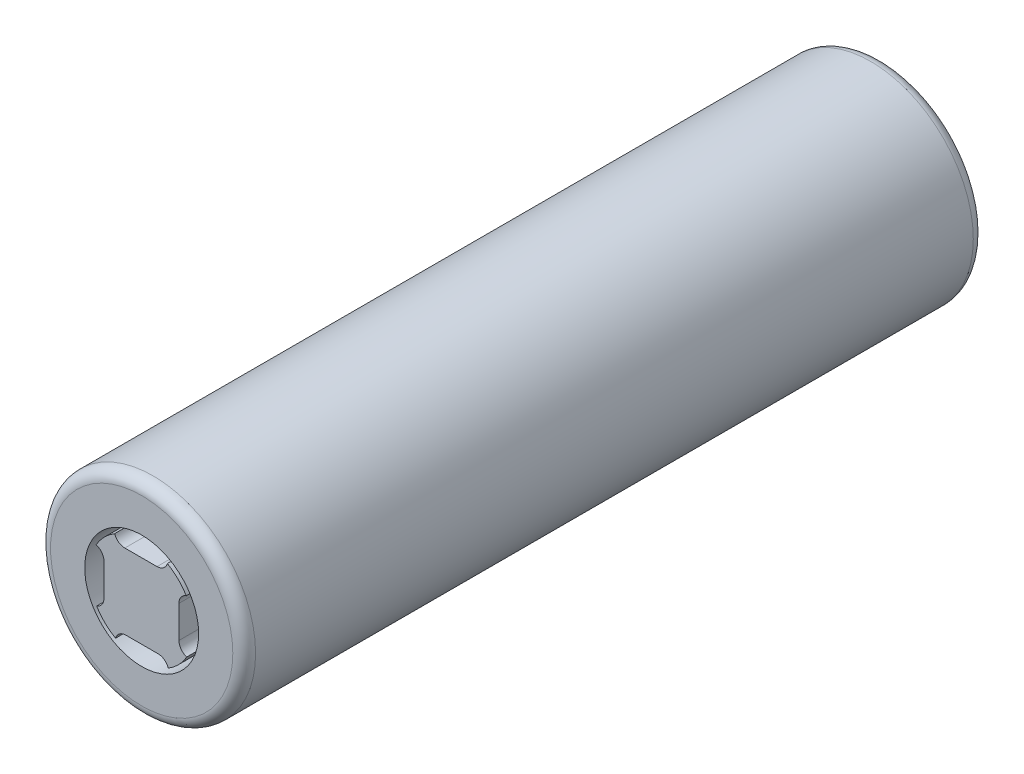
ISO-10303-21;
HEADER;
FILE_DESCRIPTION(('STEP AP214'),'2;1');
FILE_NAME('part.step','',(''),(''),'','','');
FILE_SCHEMA(('AUTOMOTIVE_DESIGN { 1 0 10303 214 1 1 1 1 }'));
ENDSEC;
DATA;
#1=APPLICATION_CONTEXT('core data for automotive mechanical design processes');
#2=APPLICATION_PROTOCOL_DEFINITION('international standard','automotive_design',2000,#1);
#3=PRODUCT_CONTEXT('',#1,'mechanical');
#4=PRODUCT('Part','Part','',(#3));
#5=PRODUCT_RELATED_PRODUCT_CATEGORY('part','',(#4));
#6=PRODUCT_DEFINITION_FORMATION('','',#4);
#7=PRODUCT_DEFINITION_CONTEXT('part definition',#1,'design');
#8=PRODUCT_DEFINITION('design','',#6,#7);
#9=PRODUCT_DEFINITION_SHAPE('','',#8);
#10=(LENGTH_UNIT() NAMED_UNIT(*) SI_UNIT(.MILLI.,.METRE.));
#11=(NAMED_UNIT(*) PLANE_ANGLE_UNIT() SI_UNIT($,.RADIAN.));
#12=(NAMED_UNIT(*) SI_UNIT($,.STERADIAN.) SOLID_ANGLE_UNIT());
#13=UNCERTAINTY_MEASURE_WITH_UNIT(LENGTH_MEASURE(1.E-05),#10,'distance_accuracy_value','');
#14=(GEOMETRIC_REPRESENTATION_CONTEXT(3) GLOBAL_UNCERTAINTY_ASSIGNED_CONTEXT((#13)) GLOBAL_UNIT_ASSIGNED_CONTEXT((#10,
#11,#12)) REPRESENTATION_CONTEXT('',''));
#15=CARTESIAN_POINT('',(0.,0.,0.));
#16=DIRECTION('',(0.,0.,1.));
#17=DIRECTION('',(1.,0.,0.));
#18=AXIS2_PLACEMENT_3D('',#15,#16,#17);
#19=CARTESIAN_POINT('',(0.,0.,-65.));
#20=DIRECTION('',(0.,0.,1.));
#21=DIRECTION('',(1.,0.,0.));
#22=AXIS2_PLACEMENT_3D('',#19,#20,#21);
#23=CYLINDRICAL_SURFACE('',#22,9.);
#24=CARTESIAN_POINT('',(0.,0.,-1.));
#25=DIRECTION('',(0.,0.,1.));
#26=DIRECTION('',(1.,0.,0.));
#27=AXIS2_PLACEMENT_3D('',#24,#25,#26);
#28=CIRCLE('',#27,9.);
#29=CARTESIAN_POINT('',(9.,0.,-1.));
#30=VERTEX_POINT('',#29);
#31=EDGE_CURVE('E52',#30,#30,#28,.F.);
#32=ORIENTED_EDGE('',*,*,#31,.T.);
#33=EDGE_LOOP('',(#32));
#34=FACE_BOUND('',#33,.T.);
#35=CARTESIAN_POINT('',(0.,0.,-64.));
#36=DIRECTION('',(0.,0.,1.));
#37=DIRECTION('',(1.,0.,0.));
#38=AXIS2_PLACEMENT_3D('',#35,#36,#37);
#39=CIRCLE('',#38,9.);
#40=CARTESIAN_POINT('',(9.,0.,-64.));
#41=VERTEX_POINT('',#40);
#42=EDGE_CURVE('E312',#41,#41,#39,.T.);
#43=ORIENTED_EDGE('',*,*,#42,.T.);
#44=EDGE_LOOP('',(#43));
#45=FACE_BOUND('',#44,.T.);
#46=ADVANCED_FACE('F43',(#34,#45),#23,.T.);
#47=CARTESIAN_POINT('',(0.,0.,-65.));
#48=DIRECTION('',(0.,0.,1.));
#49=DIRECTION('',(1.,0.,0.));
#50=AXIS2_PLACEMENT_3D('',#47,#48,#49);
#51=PLANE('',#50);
#52=CARTESIAN_POINT('',(0.,0.,-65.));
#53=DIRECTION('',(0.,0.,-1.));
#54=DIRECTION('',(-1.,0.,0.));
#55=AXIS2_PLACEMENT_3D('',#52,#53,#54);
#56=CIRCLE('',#55,6.5);
#57=CARTESIAN_POINT('',(-6.5,0.,-65.));
#58=VERTEX_POINT('',#57);
#59=EDGE_CURVE('E297',#58,#58,#56,.T.);
#60=ORIENTED_EDGE('',*,*,#59,.F.);
#61=EDGE_LOOP('',(#60));
#62=FACE_BOUND('',#61,.T.);
#63=CARTESIAN_POINT('',(0.,0.,-65.));
#64=DIRECTION('',(0.,0.,1.));
#65=DIRECTION('',(1.,0.,0.));
#66=AXIS2_PLACEMENT_3D('',#63,#64,#65);
#67=CIRCLE('',#66,8.);
#68=CARTESIAN_POINT('',(8.,0.,-65.));
#69=VERTEX_POINT('',#68);
#70=EDGE_CURVE('E11',#69,#69,#67,.F.);
#71=ORIENTED_EDGE('',*,*,#70,.T.);
#72=EDGE_LOOP('',(#71));
#73=FACE_BOUND('',#72,.T.);
#74=ADVANCED_FACE('F328',(#62,#73),#51,.F.);
#75=CARTESIAN_POINT('',(0.,0.,0.));
#76=DIRECTION('',(0.,0.,1.));
#77=DIRECTION('',(1.,0.,0.));
#78=AXIS2_PLACEMENT_3D('',#75,#76,#77);
#79=PLANE('',#78);
#80=CARTESIAN_POINT('',(0.,0.,0.));
#81=DIRECTION('',(0.,0.,1.));
#82=DIRECTION('',(1.,0.,0.));
#83=AXIS2_PLACEMENT_3D('',#80,#81,#82);
#84=CIRCLE('',#83,5.);
#85=CARTESIAN_POINT('',(5.,0.,0.));
#86=VERTEX_POINT('',#85);
#87=EDGE_CURVE('E292',#86,#86,#84,.T.);
#88=ORIENTED_EDGE('',*,*,#87,.F.);
#89=EDGE_LOOP('',(#88));
#90=FACE_BOUND('',#89,.T.);
#91=CARTESIAN_POINT('',(0.,0.,0.));
#92=DIRECTION('',(0.,0.,1.));
#93=DIRECTION('',(1.,0.,0.));
#94=AXIS2_PLACEMENT_3D('',#91,#92,#93);
#95=CIRCLE('',#94,8.);
#96=CARTESIAN_POINT('',(8.,0.,0.));
#97=VERTEX_POINT('',#96);
#98=EDGE_CURVE('E305',#97,#97,#95,.T.);
#99=ORIENTED_EDGE('',*,*,#98,.T.);
#100=EDGE_LOOP('',(#99));
#101=FACE_BOUND('',#100,.T.);
#102=ADVANCED_FACE('F324',(#90,#101),#79,.T.);
#103=CARTESIAN_POINT('',(0.,0.,-1.));
#104=DIRECTION('',(0.,0.,1.));
#105=DIRECTION('',(1.,0.,0.));
#106=AXIS2_PLACEMENT_3D('',#103,#104,#105);
#107=TOROIDAL_SURFACE('',#106,8.,1.);
#108=ORIENTED_EDGE('',*,*,#31,.F.);
#109=EDGE_LOOP('',(#108));
#110=FACE_BOUND('',#109,.T.);
#111=ORIENTED_EDGE('',*,*,#98,.F.);
#112=EDGE_LOOP('',(#111));
#113=FACE_BOUND('',#112,.T.);
#114=ADVANCED_FACE('F321',(#110,#113),#107,.T.);
#115=CARTESIAN_POINT('',(0.,0.,-64.));
#116=DIRECTION('',(0.,0.,1.));
#117=DIRECTION('',(1.,0.,0.));
#118=AXIS2_PLACEMENT_3D('',#115,#116,#117);
#119=TOROIDAL_SURFACE('',#118,8.,1.);
#120=ORIENTED_EDGE('',*,*,#70,.F.);
#121=EDGE_LOOP('',(#120));
#122=FACE_BOUND('',#121,.T.);
#123=ORIENTED_EDGE('',*,*,#42,.F.);
#124=EDGE_LOOP('',(#123));
#125=FACE_BOUND('',#124,.T.);
#126=ADVANCED_FACE('F45',(#122,#125),#119,.T.);
#127=CARTESIAN_POINT('',(0.,0.,-64.98));
#128=DIRECTION('',(0.,0.,-1.));
#129=DIRECTION('',(-1.,0.,0.));
#130=AXIS2_PLACEMENT_3D('',#127,#128,#129);
#131=CYLINDRICAL_SURFACE('',#130,6.5);
#132=CARTESIAN_POINT('',(0.,0.,-64.98));
#133=DIRECTION('',(0.,0.,-1.));
#134=DIRECTION('',(-1.,0.,0.));
#135=AXIS2_PLACEMENT_3D('',#132,#133,#134);
#136=CIRCLE('',#135,6.5);
#137=CARTESIAN_POINT('',(-6.5,0.,-64.98));
#138=VERTEX_POINT('',#137);
#139=EDGE_CURVE('E301',#138,#138,#136,.T.);
#140=ORIENTED_EDGE('',*,*,#139,.F.);
#141=EDGE_LOOP('',(#140));
#142=FACE_BOUND('',#141,.T.);
#143=ORIENTED_EDGE('',*,*,#59,.T.);
#144=EDGE_LOOP('',(#143));
#145=FACE_BOUND('',#144,.T.);
#146=ADVANCED_FACE('F360',(#142,#145),#131,.F.);
#147=CARTESIAN_POINT('',(0.,0.,-64.98));
#148=DIRECTION('',(0.,0.,-1.));
#149=DIRECTION('',(-1.,0.,0.));
#150=AXIS2_PLACEMENT_3D('',#147,#148,#149);
#151=PLANE('',#150);
#152=ORIENTED_EDGE('',*,*,#139,.T.);
#153=EDGE_LOOP('',(#152));
#154=FACE_BOUND('',#153,.T.);
#155=ADVANCED_FACE('F393',(#154),#151,.T.);
#156=CARTESIAN_POINT('',(0.,0.,-3.));
#157=DIRECTION('',(0.,0.,1.));
#158=DIRECTION('',(1.,0.,0.));
#159=AXIS2_PLACEMENT_3D('',#156,#157,#158);
#160=CYLINDRICAL_SURFACE('',#159,5.);
#161=CARTESIAN_POINT('',(0.,0.,-3.));
#162=DIRECTION('',(0.,0.,1.));
#163=DIRECTION('',(1.,0.,0.));
#164=AXIS2_PLACEMENT_3D('',#161,#162,#163);
#165=CIRCLE('',#164,5.);
#166=CARTESIAN_POINT('',(5.,0.,-3.));
#167=VERTEX_POINT('',#166);
#168=EDGE_CURVE('E293',#167,#167,#165,.T.);
#169=ORIENTED_EDGE('',*,*,#168,.F.);
#170=EDGE_LOOP('',(#169));
#171=FACE_BOUND('',#170,.T.);
#172=ORIENTED_EDGE('',*,*,#87,.T.);
#173=EDGE_LOOP('',(#172));
#174=FACE_BOUND('',#173,.T.);
#175=ADVANCED_FACE('F401',(#171,#174),#160,.F.);
#176=CARTESIAN_POINT('',(0.,0.,-3.));
#177=DIRECTION('',(0.,0.,1.));
#178=DIRECTION('',(1.,0.,0.));
#179=AXIS2_PLACEMENT_3D('',#176,#177,#178);
#180=PLANE('',#179);
#181=CARTESIAN_POINT('',(1.45860825628299,-4.23652875202125,-3.));
#182=DIRECTION('',(0.,0.,1.));
#183=DIRECTION('',(1.,0.,0.));
#184=AXIS2_PLACEMENT_3D('',#181,#182,#183);
#185=CIRCLE('',#184,0.946820821160264);
#186=CARTESIAN_POINT('',(2.35476678849302,-3.93096443386589,-3.));
#187=VERTEX_POINT('',#186);
#188=CARTESIAN_POINT('',(1.45860825628299,-3.28970793086098,-3.));
#189=VERTEX_POINT('',#188);
#190=EDGE_CURVE('E191',#187,#189,#185,.T.);
#191=ORIENTED_EDGE('',*,*,#190,.T.);
#192=DIRECTION('',(1.,0.,0.));
#193=VECTOR('',#192,1.);
#194=CARTESIAN_POINT('',(0.,-3.28970793086098,-3.));
#195=LINE('',#194,#193);
#196=CARTESIAN_POINT('',(-1.36442356825004,-3.28970793086098,-3.));
#197=VERTEX_POINT('',#196);
#198=EDGE_CURVE('E247',#197,#189,#195,.T.);
#199=ORIENTED_EDGE('',*,*,#198,.F.);
#200=CARTESIAN_POINT('',(-1.36442356825004,-4.23652875202125,-3.));
#201=DIRECTION('',(0.,0.,1.));
#202=DIRECTION('',(1.,0.,0.));
#203=AXIS2_PLACEMENT_3D('',#200,#201,#202);
#204=CIRCLE('',#203,0.946820821160266);
#205=CARTESIAN_POINT('',(-2.27514519868079,-3.97757744530865,-3.));
#206=VERTEX_POINT('',#205);
#207=EDGE_CURVE('E59',#197,#206,#204,.T.);
#208=ORIENTED_EDGE('',*,*,#207,.T.);
#209=CARTESIAN_POINT('',(0.,0.,-3.));
#210=DIRECTION('',(0.,0.,1.));
#211=DIRECTION('',(1.,0.,0.));
#212=AXIS2_PLACEMENT_3D('',#209,#210,#211);
#213=CIRCLE('',#212,4.58229287677123);
#214=CARTESIAN_POINT('',(-3.9309644338659,-2.35476678849301,-3.));
#215=VERTEX_POINT('',#214);
#216=EDGE_CURVE('E179',#215,#206,#213,.T.);
#217=ORIENTED_EDGE('',*,*,#216,.F.);
#218=CARTESIAN_POINT('',(-4.23652875202125,-1.45860825628297,-3.));
#219=DIRECTION('',(0.,0.,1.));
#220=DIRECTION('',(1.,0.,0.));
#221=AXIS2_PLACEMENT_3D('',#218,#219,#220);
#222=CIRCLE('',#221,0.946820821160266);
#223=CARTESIAN_POINT('',(-3.28970793086099,-1.45860825628298,-3.));
#224=VERTEX_POINT('',#223);
#225=EDGE_CURVE('E239',#215,#224,#222,.T.);
#226=ORIENTED_EDGE('',*,*,#225,.T.);
#227=DIRECTION('',(0.,-1.,0.));
#228=VECTOR('',#227,1.);
#229=CARTESIAN_POINT('',(-3.28970793086098,0.,-3.));
#230=LINE('',#229,#228);
#231=CARTESIAN_POINT('',(-3.28970793086098,1.36442356825005,-3.));
#232=VERTEX_POINT('',#231);
#233=EDGE_CURVE('E235',#232,#224,#230,.T.);
#234=ORIENTED_EDGE('',*,*,#233,.F.);
#235=CARTESIAN_POINT('',(-4.23652875202124,1.36442356825006,-3.));
#236=DIRECTION('',(0.,0.,1.));
#237=DIRECTION('',(1.,0.,0.));
#238=AXIS2_PLACEMENT_3D('',#235,#236,#237);
#239=CIRCLE('',#238,0.946820821160266);
#240=CARTESIAN_POINT('',(-3.97757744530864,2.2751451986808,-3.));
#241=VERTEX_POINT('',#240);
#242=EDGE_CURVE('E231',#232,#241,#239,.T.);
#243=ORIENTED_EDGE('',*,*,#242,.T.);
#244=CARTESIAN_POINT('',(0.,0.,-3.));
#245=DIRECTION('',(0.,0.,1.));
#246=DIRECTION('',(1.,0.,0.));
#247=AXIS2_PLACEMENT_3D('',#244,#245,#246);
#248=CIRCLE('',#247,4.58229287677123);
#249=CARTESIAN_POINT('',(-2.354766788493,3.93096443386591,-3.));
#250=VERTEX_POINT('',#249);
#251=EDGE_CURVE('E227',#250,#241,#248,.T.);
#252=ORIENTED_EDGE('',*,*,#251,.F.);
#253=CARTESIAN_POINT('',(-1.45860825628296,4.23652875202126,-3.));
#254=DIRECTION('',(0.,0.,1.));
#255=DIRECTION('',(1.,0.,0.));
#256=AXIS2_PLACEMENT_3D('',#253,#254,#255);
#257=CIRCLE('',#256,0.946820821160266);
#258=CARTESIAN_POINT('',(-1.45860825628296,3.28970793086099,-3.));
#259=VERTEX_POINT('',#258);
#260=EDGE_CURVE('E223',#250,#259,#257,.T.);
#261=ORIENTED_EDGE('',*,*,#260,.T.);
#262=DIRECTION('',(-1.,0.,0.));
#263=VECTOR('',#262,1.);
#264=CARTESIAN_POINT('',(0.,3.28970793086098,-3.));
#265=LINE('',#264,#263);
#266=CARTESIAN_POINT('',(1.36442356825007,3.28970793086098,-3.));
#267=VERTEX_POINT('',#266);
#268=EDGE_CURVE('E219',#267,#259,#265,.T.);
#269=ORIENTED_EDGE('',*,*,#268,.F.);
#270=CARTESIAN_POINT('',(1.36442356825007,4.23652875202124,-3.));
#271=DIRECTION('',(0.,0.,1.));
#272=DIRECTION('',(1.,0.,0.));
#273=AXIS2_PLACEMENT_3D('',#270,#271,#272);
#274=CIRCLE('',#273,0.946820821160266);
#275=CARTESIAN_POINT('',(2.27514519868082,3.97757744530863,-3.));
#276=VERTEX_POINT('',#275);
#277=EDGE_CURVE('E215',#267,#276,#274,.T.);
#278=ORIENTED_EDGE('',*,*,#277,.T.);
#279=CARTESIAN_POINT('',(0.,0.,-3.));
#280=DIRECTION('',(0.,0.,1.));
#281=DIRECTION('',(1.,0.,0.));
#282=AXIS2_PLACEMENT_3D('',#279,#280,#281);
#283=CIRCLE('',#282,4.58229287677123);
#284=CARTESIAN_POINT('',(3.93096443386591,2.35476678849298,-3.));
#285=VERTEX_POINT('',#284);
#286=EDGE_CURVE('E211',#285,#276,#283,.T.);
#287=ORIENTED_EDGE('',*,*,#286,.F.);
#288=CARTESIAN_POINT('',(4.23652875202126,1.45860825628294,-3.));
#289=DIRECTION('',(0.,0.,1.));
#290=DIRECTION('',(1.,0.,0.));
#291=AXIS2_PLACEMENT_3D('',#288,#289,#290);
#292=CIRCLE('',#291,0.946820821160266);
#293=CARTESIAN_POINT('',(3.289707930861,1.45860825628295,-3.));
#294=VERTEX_POINT('',#293);
#295=EDGE_CURVE('E207',#285,#294,#292,.T.);
#296=ORIENTED_EDGE('',*,*,#295,.T.);
#297=DIRECTION('',(0.,1.,0.));
#298=VECTOR('',#297,1.);
#299=CARTESIAN_POINT('',(3.28970793086098,0.,-3.));
#300=LINE('',#299,#298);
#301=CARTESIAN_POINT('',(3.28970793086097,-1.36442356825008,-3.));
#302=VERTEX_POINT('',#301);
#303=EDGE_CURVE('E203',#302,#294,#300,.T.);
#304=ORIENTED_EDGE('',*,*,#303,.F.);
#305=CARTESIAN_POINT('',(4.23652875202124,-1.36442356825009,-3.));
#306=DIRECTION('',(0.,0.,1.));
#307=DIRECTION('',(1.,0.,0.));
#308=AXIS2_PLACEMENT_3D('',#305,#306,#307);
#309=CIRCLE('',#308,0.946820821160266);
#310=CARTESIAN_POINT('',(3.97757744530862,-2.27514519868083,-3.));
#311=VERTEX_POINT('',#310);
#312=EDGE_CURVE('E199',#302,#311,#309,.T.);
#313=ORIENTED_EDGE('',*,*,#312,.T.);
#314=CARTESIAN_POINT('',(0.,0.,-3.));
#315=DIRECTION('',(0.,0.,1.));
#316=DIRECTION('',(1.,0.,0.));
#317=AXIS2_PLACEMENT_3D('',#314,#315,#316);
#318=CIRCLE('',#317,4.58229287677123);
#319=EDGE_CURVE('E195',#187,#311,#318,.T.);
#320=ORIENTED_EDGE('',*,*,#319,.F.);
#321=EDGE_LOOP('',(#191,#199,#208,#217,#226,#234,#243,#252,#261,#269,#278,#287,#296,#304,#313,#320));
#322=FACE_BOUND('',#321,.T.);
#323=ORIENTED_EDGE('',*,*,#168,.T.);
#324=EDGE_LOOP('',(#323));
#325=FACE_BOUND('',#324,.T.);
#326=ADVANCED_FACE('F409',(#322,#325),#180,.T.);
#327=CARTESIAN_POINT('',(1.45860825628299,-4.23652875202125,0.0200000000000001));
#328=DIRECTION('',(0.,0.,-1.));
#329=DIRECTION('',(-1.,0.,0.));
#330=AXIS2_PLACEMENT_3D('',#327,#328,#329);
#331=CYLINDRICAL_SURFACE('',#330,0.946820821160264);
#332=ORIENTED_EDGE('',*,*,#190,.F.);
#333=DIRECTION('',(0.,0.,-1.));
#334=VECTOR('',#333,1.);
#335=CARTESIAN_POINT('',(2.35476678849302,-3.93096443386589,0.0200000000000001));
#336=LINE('',#335,#334);
#337=CARTESIAN_POINT('',(2.35476678849302,-3.93096443386589,0.0200000000000001));
#338=VERTEX_POINT('',#337);
#339=EDGE_CURVE('E125',#338,#187,#336,.T.);
#340=ORIENTED_EDGE('',*,*,#339,.F.);
#341=CARTESIAN_POINT('',(1.45860825628299,-4.23652875202125,0.0200000000000001));
#342=DIRECTION('',(0.,0.,1.));
#343=DIRECTION('',(1.,0.,0.));
#344=AXIS2_PLACEMENT_3D('',#341,#342,#343);
#345=CIRCLE('',#344,0.946820821160264);
#346=CARTESIAN_POINT('',(1.45860825628299,-3.28970793086098,0.0200000000000001));
#347=VERTEX_POINT('',#346);
#348=EDGE_CURVE('E250',#338,#347,#345,.T.);
#349=ORIENTED_EDGE('',*,*,#348,.T.);
#350=DIRECTION('',(0.,0.,-1.));
#351=VECTOR('',#350,1.);
#352=CARTESIAN_POINT('',(1.45860825628299,-3.28970793086098,0.0200000000000001));
#353=LINE('',#352,#351);
#354=EDGE_CURVE('E120',#347,#189,#353,.T.);
#355=ORIENTED_EDGE('',*,*,#354,.T.);
#356=EDGE_LOOP('',(#332,#340,#349,#355));
#357=FACE_BOUND('',#356,.T.);
#358=ADVANCED_FACE('F418',(#357),#331,.F.);
#359=CARTESIAN_POINT('',(0.,0.,0.0200000000000001));
#360=DIRECTION('',(0.,0.,-1.));
#361=DIRECTION('',(-1.,0.,0.));
#362=AXIS2_PLACEMENT_3D('',#359,#360,#361);
#363=CYLINDRICAL_SURFACE('',#362,4.58229287677123);
#364=ORIENTED_EDGE('',*,*,#319,.T.);
#365=DIRECTION('',(0.,0.,-1.));
#366=VECTOR('',#365,1.);
#367=CARTESIAN_POINT('',(3.97757744530862,-2.27514519868083,0.0200000000000001));
#368=LINE('',#367,#366);
#369=CARTESIAN_POINT('',(3.97757744530862,-2.27514519868083,0.0200000000000001));
#370=VERTEX_POINT('',#369);
#371=EDGE_CURVE('E287',#370,#311,#368,.T.);
#372=ORIENTED_EDGE('',*,*,#371,.F.);
#373=CARTESIAN_POINT('',(0.,0.,0.0200000000000001));
#374=DIRECTION('',(0.,0.,1.));
#375=DIRECTION('',(1.,0.,0.));
#376=AXIS2_PLACEMENT_3D('',#373,#374,#375);
#377=CIRCLE('',#376,4.58229287677123);
#378=EDGE_CURVE('E629',#338,#370,#377,.T.);
#379=ORIENTED_EDGE('',*,*,#378,.F.);
#380=ORIENTED_EDGE('',*,*,#339,.T.);
#381=EDGE_LOOP('',(#364,#372,#379,#380));
#382=FACE_BOUND('',#381,.T.);
#383=ADVANCED_FACE('F427',(#382),#363,.T.);
#384=CARTESIAN_POINT('',(4.23652875202124,-1.36442356825009,0.0200000000000001));
#385=DIRECTION('',(0.,0.,-1.));
#386=DIRECTION('',(-1.,0.,0.));
#387=AXIS2_PLACEMENT_3D('',#384,#385,#386);
#388=CYLINDRICAL_SURFACE('',#387,0.946820821160266);
#389=ORIENTED_EDGE('',*,*,#312,.F.);
#390=DIRECTION('',(0.,0.,-1.));
#391=VECTOR('',#390,1.);
#392=CARTESIAN_POINT('',(3.28970793086097,-1.36442356825008,0.0200000000000001));
#393=LINE('',#392,#391);
#394=CARTESIAN_POINT('',(3.28970793086097,-1.36442356825008,0.0200000000000001));
#395=VERTEX_POINT('',#394);
#396=EDGE_CURVE('E284',#395,#302,#393,.T.);
#397=ORIENTED_EDGE('',*,*,#396,.F.);
#398=CARTESIAN_POINT('',(4.23652875202124,-1.36442356825009,0.0200000000000001));
#399=DIRECTION('',(0.,0.,1.));
#400=DIRECTION('',(1.,0.,0.));
#401=AXIS2_PLACEMENT_3D('',#398,#399,#400);
#402=CIRCLE('',#401,0.946820821160266);
#403=EDGE_CURVE('E632',#395,#370,#402,.T.);
#404=ORIENTED_EDGE('',*,*,#403,.T.);
#405=ORIENTED_EDGE('',*,*,#371,.T.);
#406=EDGE_LOOP('',(#389,#397,#404,#405));
#407=FACE_BOUND('',#406,.T.);
#408=ADVANCED_FACE('F435',(#407),#388,.F.);
#409=CARTESIAN_POINT('',(3.28970793086098,0.,0.0200000000000001));
#410=DIRECTION('',(-1.,0.,0.));
#411=DIRECTION('',(0.,-1.,0.));
#412=AXIS2_PLACEMENT_3D('',#409,#410,#411);
#413=PLANE('',#412);
#414=ORIENTED_EDGE('',*,*,#303,.T.);
#415=DIRECTION('',(0.,0.,-1.));
#416=VECTOR('',#415,1.);
#417=CARTESIAN_POINT('',(3.289707930861,1.45860825628295,0.0200000000000001));
#418=LINE('',#417,#416);
#419=CARTESIAN_POINT('',(3.289707930861,1.45860825628295,0.0200000000000001));
#420=VERTEX_POINT('',#419);
#421=EDGE_CURVE('E281',#420,#294,#418,.T.);
#422=ORIENTED_EDGE('',*,*,#421,.F.);
#423=DIRECTION('',(0.,1.,0.));
#424=VECTOR('',#423,1.);
#425=CARTESIAN_POINT('',(3.28970793086098,0.,0.0200000000000001));
#426=LINE('',#425,#424);
#427=EDGE_CURVE('E639',#395,#420,#426,.T.);
#428=ORIENTED_EDGE('',*,*,#427,.F.);
#429=ORIENTED_EDGE('',*,*,#396,.T.);
#430=EDGE_LOOP('',(#414,#422,#428,#429));
#431=FACE_BOUND('',#430,.T.);
#432=ADVANCED_FACE('F453',(#431),#413,.F.);
#433=CARTESIAN_POINT('',(4.23652875202126,1.45860825628294,0.0200000000000001));
#434=DIRECTION('',(0.,0.,-1.));
#435=DIRECTION('',(-1.,0.,0.));
#436=AXIS2_PLACEMENT_3D('',#433,#434,#435);
#437=CYLINDRICAL_SURFACE('',#436,0.946820821160266);
#438=ORIENTED_EDGE('',*,*,#295,.F.);
#439=DIRECTION('',(0.,0.,-1.));
#440=VECTOR('',#439,1.);
#441=CARTESIAN_POINT('',(3.93096443386591,2.35476678849298,0.0200000000000001));
#442=LINE('',#441,#440);
#443=CARTESIAN_POINT('',(3.93096443386591,2.35476678849298,0.0200000000000001));
#444=VERTEX_POINT('',#443);
#445=EDGE_CURVE('E278',#444,#285,#442,.T.);
#446=ORIENTED_EDGE('',*,*,#445,.F.);
#447=CARTESIAN_POINT('',(4.23652875202126,1.45860825628294,0.0200000000000001));
#448=DIRECTION('',(0.,0.,1.));
#449=DIRECTION('',(1.,0.,0.));
#450=AXIS2_PLACEMENT_3D('',#447,#448,#449);
#451=CIRCLE('',#450,0.946820821160266);
#452=EDGE_CURVE('E642',#444,#420,#451,.T.);
#453=ORIENTED_EDGE('',*,*,#452,.T.);
#454=ORIENTED_EDGE('',*,*,#421,.T.);
#455=EDGE_LOOP('',(#438,#446,#453,#454));
#456=FACE_BOUND('',#455,.T.);
#457=ADVANCED_FACE('F462',(#456),#437,.F.);
#458=CARTESIAN_POINT('',(0.,0.,0.0200000000000001));
#459=DIRECTION('',(0.,0.,-1.));
#460=DIRECTION('',(-1.,0.,0.));
#461=AXIS2_PLACEMENT_3D('',#458,#459,#460);
#462=CYLINDRICAL_SURFACE('',#461,4.58229287677123);
#463=ORIENTED_EDGE('',*,*,#286,.T.);
#464=DIRECTION('',(0.,0.,-1.));
#465=VECTOR('',#464,1.);
#466=CARTESIAN_POINT('',(2.27514519868082,3.97757744530863,0.0200000000000001));
#467=LINE('',#466,#465);
#468=CARTESIAN_POINT('',(2.27514519868082,3.97757744530863,0.0200000000000001));
#469=VERTEX_POINT('',#468);
#470=EDGE_CURVE('E275',#469,#276,#467,.T.);
#471=ORIENTED_EDGE('',*,*,#470,.F.);
#472=CARTESIAN_POINT('',(0.,0.,0.0200000000000001));
#473=DIRECTION('',(0.,0.,1.));
#474=DIRECTION('',(1.,0.,0.));
#475=AXIS2_PLACEMENT_3D('',#472,#473,#474);
#476=CIRCLE('',#475,4.58229287677123);
#477=EDGE_CURVE('E646',#444,#469,#476,.T.);
#478=ORIENTED_EDGE('',*,*,#477,.F.);
#479=ORIENTED_EDGE('',*,*,#445,.T.);
#480=EDGE_LOOP('',(#463,#471,#478,#479));
#481=FACE_BOUND('',#480,.T.);
#482=ADVANCED_FACE('F471',(#481),#462,.T.);
#483=CARTESIAN_POINT('',(1.36442356825007,4.23652875202124,0.0200000000000001));
#484=DIRECTION('',(0.,0.,-1.));
#485=DIRECTION('',(-1.,0.,0.));
#486=AXIS2_PLACEMENT_3D('',#483,#484,#485);
#487=CYLINDRICAL_SURFACE('',#486,0.946820821160266);
#488=ORIENTED_EDGE('',*,*,#277,.F.);
#489=DIRECTION('',(0.,0.,-1.));
#490=VECTOR('',#489,1.);
#491=CARTESIAN_POINT('',(1.36442356825007,3.28970793086098,0.0200000000000001));
#492=LINE('',#491,#490);
#493=CARTESIAN_POINT('',(1.36442356825007,3.28970793086098,0.0200000000000001));
#494=VERTEX_POINT('',#493);
#495=EDGE_CURVE('E272',#494,#267,#492,.T.);
#496=ORIENTED_EDGE('',*,*,#495,.F.);
#497=CARTESIAN_POINT('',(1.36442356825007,4.23652875202124,0.0200000000000001));
#498=DIRECTION('',(0.,0.,1.));
#499=DIRECTION('',(1.,0.,0.));
#500=AXIS2_PLACEMENT_3D('',#497,#498,#499);
#501=CIRCLE('',#500,0.946820821160266);
#502=EDGE_CURVE('E649',#494,#469,#501,.T.);
#503=ORIENTED_EDGE('',*,*,#502,.T.);
#504=ORIENTED_EDGE('',*,*,#470,.T.);
#505=EDGE_LOOP('',(#488,#496,#503,#504));
#506=FACE_BOUND('',#505,.T.);
#507=ADVANCED_FACE('F480',(#506),#487,.F.);
#508=CARTESIAN_POINT('',(0.,3.28970793086098,0.0200000000000001));
#509=DIRECTION('',(0.,-1.,0.));
#510=DIRECTION('',(1.,0.,0.));
#511=AXIS2_PLACEMENT_3D('',#508,#509,#510);
#512=PLANE('',#511);
#513=ORIENTED_EDGE('',*,*,#268,.T.);
#514=DIRECTION('',(0.,0.,-1.));
#515=VECTOR('',#514,1.);
#516=CARTESIAN_POINT('',(-1.45860825628296,3.28970793086099,0.0200000000000001));
#517=LINE('',#516,#515);
#518=CARTESIAN_POINT('',(-1.45860825628296,3.28970793086099,0.0200000000000001));
#519=VERTEX_POINT('',#518);
#520=EDGE_CURVE('E269',#519,#259,#517,.T.);
#521=ORIENTED_EDGE('',*,*,#520,.F.);
#522=DIRECTION('',(-1.,0.,0.));
#523=VECTOR('',#522,1.);
#524=CARTESIAN_POINT('',(0.,3.28970793086098,0.0200000000000001));
#525=LINE('',#524,#523);
#526=EDGE_CURVE('E653',#494,#519,#525,.T.);
#527=ORIENTED_EDGE('',*,*,#526,.F.);
#528=ORIENTED_EDGE('',*,*,#495,.T.);
#529=EDGE_LOOP('',(#513,#521,#527,#528));
#530=FACE_BOUND('',#529,.T.);
#531=ADVANCED_FACE('F498',(#530),#512,.F.);
#532=CARTESIAN_POINT('',(-1.45860825628296,4.23652875202126,0.0200000000000001));
#533=DIRECTION('',(0.,0.,-1.));
#534=DIRECTION('',(-1.,0.,0.));
#535=AXIS2_PLACEMENT_3D('',#532,#533,#534);
#536=CYLINDRICAL_SURFACE('',#535,0.946820821160266);
#537=ORIENTED_EDGE('',*,*,#260,.F.);
#538=DIRECTION('',(0.,0.,-1.));
#539=VECTOR('',#538,1.);
#540=CARTESIAN_POINT('',(-2.354766788493,3.93096443386591,0.0200000000000001));
#541=LINE('',#540,#539);
#542=CARTESIAN_POINT('',(-2.354766788493,3.93096443386591,0.0200000000000001));
#543=VERTEX_POINT('',#542);
#544=EDGE_CURVE('E266',#543,#250,#541,.T.);
#545=ORIENTED_EDGE('',*,*,#544,.F.);
#546=CARTESIAN_POINT('',(-1.45860825628296,4.23652875202126,0.0200000000000001));
#547=DIRECTION('',(0.,0.,1.));
#548=DIRECTION('',(1.,0.,0.));
#549=AXIS2_PLACEMENT_3D('',#546,#547,#548);
#550=CIRCLE('',#549,0.946820821160266);
#551=EDGE_CURVE('E656',#543,#519,#550,.T.);
#552=ORIENTED_EDGE('',*,*,#551,.T.);
#553=ORIENTED_EDGE('',*,*,#520,.T.);
#554=EDGE_LOOP('',(#537,#545,#552,#553));
#555=FACE_BOUND('',#554,.T.);
#556=ADVANCED_FACE('F507',(#555),#536,.F.);
#557=CARTESIAN_POINT('',(0.,0.,0.0200000000000001));
#558=DIRECTION('',(0.,0.,-1.));
#559=DIRECTION('',(-1.,0.,0.));
#560=AXIS2_PLACEMENT_3D('',#557,#558,#559);
#561=CYLINDRICAL_SURFACE('',#560,4.58229287677123);
#562=ORIENTED_EDGE('',*,*,#251,.T.);
#563=DIRECTION('',(0.,0.,-1.));
#564=VECTOR('',#563,1.);
#565=CARTESIAN_POINT('',(-3.97757744530864,2.2751451986808,0.0200000000000001));
#566=LINE('',#565,#564);
#567=CARTESIAN_POINT('',(-3.97757744530864,2.2751451986808,0.0200000000000001));
#568=VERTEX_POINT('',#567);
#569=EDGE_CURVE('E263',#568,#241,#566,.T.);
#570=ORIENTED_EDGE('',*,*,#569,.F.);
#571=CARTESIAN_POINT('',(0.,0.,0.0200000000000001));
#572=DIRECTION('',(0.,0.,1.));
#573=DIRECTION('',(1.,0.,0.));
#574=AXIS2_PLACEMENT_3D('',#571,#572,#573);
#575=CIRCLE('',#574,4.58229287677123);
#576=EDGE_CURVE('E660',#543,#568,#575,.T.);
#577=ORIENTED_EDGE('',*,*,#576,.F.);
#578=ORIENTED_EDGE('',*,*,#544,.T.);
#579=EDGE_LOOP('',(#562,#570,#577,#578));
#580=FACE_BOUND('',#579,.T.);
#581=ADVANCED_FACE('F516',(#580),#561,.T.);
#582=CARTESIAN_POINT('',(-4.23652875202124,1.36442356825006,0.0200000000000001));
#583=DIRECTION('',(0.,0.,-1.));
#584=DIRECTION('',(-1.,0.,0.));
#585=AXIS2_PLACEMENT_3D('',#582,#583,#584);
#586=CYLINDRICAL_SURFACE('',#585,0.946820821160266);
#587=ORIENTED_EDGE('',*,*,#242,.F.);
#588=DIRECTION('',(0.,0.,-1.));
#589=VECTOR('',#588,1.);
#590=CARTESIAN_POINT('',(-3.28970793086098,1.36442356825005,0.0200000000000001));
#591=LINE('',#590,#589);
#592=CARTESIAN_POINT('',(-3.28970793086098,1.36442356825005,0.0200000000000001));
#593=VERTEX_POINT('',#592);
#594=EDGE_CURVE('E260',#593,#232,#591,.T.);
#595=ORIENTED_EDGE('',*,*,#594,.F.);
#596=CARTESIAN_POINT('',(-4.23652875202124,1.36442356825006,0.0200000000000001));
#597=DIRECTION('',(0.,0.,1.));
#598=DIRECTION('',(1.,0.,0.));
#599=AXIS2_PLACEMENT_3D('',#596,#597,#598);
#600=CIRCLE('',#599,0.946820821160266);
#601=EDGE_CURVE('E663',#593,#568,#600,.T.);
#602=ORIENTED_EDGE('',*,*,#601,.T.);
#603=ORIENTED_EDGE('',*,*,#569,.T.);
#604=EDGE_LOOP('',(#587,#595,#602,#603));
#605=FACE_BOUND('',#604,.T.);
#606=ADVANCED_FACE('F525',(#605),#586,.F.);
#607=CARTESIAN_POINT('',(-3.28970793086098,0.,0.0200000000000001));
#608=DIRECTION('',(1.,0.,0.));
#609=DIRECTION('',(0.,1.,0.));
#610=AXIS2_PLACEMENT_3D('',#607,#608,#609);
#611=PLANE('',#610);
#612=ORIENTED_EDGE('',*,*,#233,.T.);
#613=DIRECTION('',(0.,0.,-1.));
#614=VECTOR('',#613,1.);
#615=CARTESIAN_POINT('',(-3.28970793086099,-1.45860825628298,0.0200000000000001));
#616=LINE('',#615,#614);
#617=CARTESIAN_POINT('',(-3.28970793086099,-1.45860825628298,0.0200000000000001));
#618=VERTEX_POINT('',#617);
#619=EDGE_CURVE('E257',#618,#224,#616,.T.);
#620=ORIENTED_EDGE('',*,*,#619,.F.);
#621=DIRECTION('',(0.,-1.,0.));
#622=VECTOR('',#621,1.);
#623=CARTESIAN_POINT('',(-3.28970793086098,0.,0.0200000000000001));
#624=LINE('',#623,#622);
#625=EDGE_CURVE('E667',#593,#618,#624,.T.);
#626=ORIENTED_EDGE('',*,*,#625,.F.);
#627=ORIENTED_EDGE('',*,*,#594,.T.);
#628=EDGE_LOOP('',(#612,#620,#626,#627));
#629=FACE_BOUND('',#628,.T.);
#630=ADVANCED_FACE('F543',(#629),#611,.F.);
#631=CARTESIAN_POINT('',(-4.23652875202125,-1.45860825628297,0.0200000000000001));
#632=DIRECTION('',(0.,0.,-1.));
#633=DIRECTION('',(-1.,0.,0.));
#634=AXIS2_PLACEMENT_3D('',#631,#632,#633);
#635=CYLINDRICAL_SURFACE('',#634,0.946820821160266);
#636=ORIENTED_EDGE('',*,*,#225,.F.);
#637=DIRECTION('',(0.,0.,-1.));
#638=VECTOR('',#637,1.);
#639=CARTESIAN_POINT('',(-3.9309644338659,-2.35476678849301,0.0200000000000001));
#640=LINE('',#639,#638);
#641=CARTESIAN_POINT('',(-3.9309644338659,-2.35476678849301,0.0200000000000001));
#642=VERTEX_POINT('',#641);
#643=EDGE_CURVE('E181',#642,#215,#640,.T.);
#644=ORIENTED_EDGE('',*,*,#643,.F.);
#645=CARTESIAN_POINT('',(-4.23652875202125,-1.45860825628297,0.0200000000000001));
#646=DIRECTION('',(0.,0.,1.));
#647=DIRECTION('',(1.,0.,0.));
#648=AXIS2_PLACEMENT_3D('',#645,#646,#647);
#649=CIRCLE('',#648,0.946820821160266);
#650=EDGE_CURVE('E171',#642,#618,#649,.T.);
#651=ORIENTED_EDGE('',*,*,#650,.T.);
#652=ORIENTED_EDGE('',*,*,#619,.T.);
#653=EDGE_LOOP('',(#636,#644,#651,#652));
#654=FACE_BOUND('',#653,.T.);
#655=ADVANCED_FACE('F552',(#654),#635,.F.);
#656=CARTESIAN_POINT('',(0.,0.,0.0200000000000001));
#657=DIRECTION('',(0.,0.,-1.));
#658=DIRECTION('',(-1.,0.,0.));
#659=AXIS2_PLACEMENT_3D('',#656,#657,#658);
#660=CYLINDRICAL_SURFACE('',#659,4.58229287677123);
#661=ORIENTED_EDGE('',*,*,#216,.T.);
#662=DIRECTION('',(0.,0.,-1.));
#663=VECTOR('',#662,1.);
#664=CARTESIAN_POINT('',(-2.27514519868079,-3.97757744530865,0.0200000000000001));
#665=LINE('',#664,#663);
#666=CARTESIAN_POINT('',(-2.27514519868079,-3.97757744530865,0.0200000000000001));
#667=VERTEX_POINT('',#666);
#668=EDGE_CURVE('E176',#667,#206,#665,.T.);
#669=ORIENTED_EDGE('',*,*,#668,.F.);
#670=CARTESIAN_POINT('',(0.,0.,0.0200000000000001));
#671=DIRECTION('',(0.,0.,1.));
#672=DIRECTION('',(1.,0.,0.));
#673=AXIS2_PLACEMENT_3D('',#670,#671,#672);
#674=CIRCLE('',#673,4.58229287677123);
#675=EDGE_CURVE('E165',#642,#667,#674,.T.);
#676=ORIENTED_EDGE('',*,*,#675,.F.);
#677=ORIENTED_EDGE('',*,*,#643,.T.);
#678=EDGE_LOOP('',(#661,#669,#676,#677));
#679=FACE_BOUND('',#678,.T.);
#680=ADVANCED_FACE('F177',(#679),#660,.T.);
#681=CARTESIAN_POINT('',(-1.36442356825004,-4.23652875202125,0.0200000000000001));
#682=DIRECTION('',(0.,0.,-1.));
#683=DIRECTION('',(-1.,0.,0.));
#684=AXIS2_PLACEMENT_3D('',#681,#682,#683);
#685=CYLINDRICAL_SURFACE('',#684,0.946820821160266);
#686=ORIENTED_EDGE('',*,*,#207,.F.);
#687=DIRECTION('',(0.,0.,-1.));
#688=VECTOR('',#687,1.);
#689=CARTESIAN_POINT('',(-1.36442356825004,-3.28970793086098,0.0200000000000001));
#690=LINE('',#689,#688);
#691=CARTESIAN_POINT('',(-1.36442356825004,-3.28970793086098,0.0200000000000001));
#692=VERTEX_POINT('',#691);
#693=EDGE_CURVE('E182',#692,#197,#690,.T.);
#694=ORIENTED_EDGE('',*,*,#693,.F.);
#695=CARTESIAN_POINT('',(-1.36442356825004,-4.23652875202125,0.0200000000000001));
#696=DIRECTION('',(0.,0.,1.));
#697=DIRECTION('',(1.,0.,0.));
#698=AXIS2_PLACEMENT_3D('',#695,#696,#697);
#699=CIRCLE('',#698,0.946820821160266);
#700=EDGE_CURVE('E169',#692,#667,#699,.T.);
#701=ORIENTED_EDGE('',*,*,#700,.T.);
#702=ORIENTED_EDGE('',*,*,#668,.T.);
#703=EDGE_LOOP('',(#686,#694,#701,#702));
#704=FACE_BOUND('',#703,.T.);
#705=ADVANCED_FACE('F184',(#704),#685,.F.);
#706=CARTESIAN_POINT('',(0.,-3.28970793086098,0.0200000000000001));
#707=DIRECTION('',(0.,1.,0.));
#708=DIRECTION('',(0.,0.,1.));
#709=AXIS2_PLACEMENT_3D('',#706,#707,#708);
#710=PLANE('',#709);
#711=ORIENTED_EDGE('',*,*,#198,.T.);
#712=ORIENTED_EDGE('',*,*,#354,.F.);
#713=DIRECTION('',(1.,0.,0.));
#714=VECTOR('',#713,1.);
#715=CARTESIAN_POINT('',(0.,-3.28970793086098,0.0200000000000001));
#716=LINE('',#715,#714);
#717=EDGE_CURVE('E68',#692,#347,#716,.T.);
#718=ORIENTED_EDGE('',*,*,#717,.F.);
#719=ORIENTED_EDGE('',*,*,#693,.T.);
#720=EDGE_LOOP('',(#711,#712,#718,#719));
#721=FACE_BOUND('',#720,.T.);
#722=ADVANCED_FACE('F585',(#721),#710,.F.);
#723=CARTESIAN_POINT('',(0.,0.,0.0200000000000001));
#724=DIRECTION('',(0.,0.,1.));
#725=DIRECTION('',(1.,0.,0.));
#726=AXIS2_PLACEMENT_3D('',#723,#724,#725);
#727=PLANE('',#726);
#728=ORIENTED_EDGE('',*,*,#348,.F.);
#729=ORIENTED_EDGE('',*,*,#378,.T.);
#730=ORIENTED_EDGE('',*,*,#403,.F.);
#731=ORIENTED_EDGE('',*,*,#427,.T.);
#732=ORIENTED_EDGE('',*,*,#452,.F.);
#733=ORIENTED_EDGE('',*,*,#477,.T.);
#734=ORIENTED_EDGE('',*,*,#502,.F.);
#735=ORIENTED_EDGE('',*,*,#526,.T.);
#736=ORIENTED_EDGE('',*,*,#551,.F.);
#737=ORIENTED_EDGE('',*,*,#576,.T.);
#738=ORIENTED_EDGE('',*,*,#601,.F.);
#739=ORIENTED_EDGE('',*,*,#625,.T.);
#740=ORIENTED_EDGE('',*,*,#650,.F.);
#741=ORIENTED_EDGE('',*,*,#675,.T.);
#742=ORIENTED_EDGE('',*,*,#700,.F.);
#743=ORIENTED_EDGE('',*,*,#717,.T.);
#744=EDGE_LOOP('',(#728,#729,#730,#731,#732,#733,#734,#735,#736,#737,#738,#739,#740,#741,#742,#743));
#745=FACE_BOUND('',#744,.T.);
#746=ADVANCED_FACE('F167',(#745),#727,.T.);
#747=CLOSED_SHELL('',(#46,#74,#102,#114,#126,#146,#155,#175,#326,#358,#383,#408,#432,#457,#482,
#507,#531,#556,#581,#606,#630,#655,#680,#705,#722,#746));
#748=MANIFOLD_SOLID_BREP('B2',#747);
#749=ADVANCED_BREP_SHAPE_REPRESENTATION('',(#18,#748),#14);
#750=SHAPE_DEFINITION_REPRESENTATION(#9,#749);
ENDSEC;
END-ISO-10303-21;
